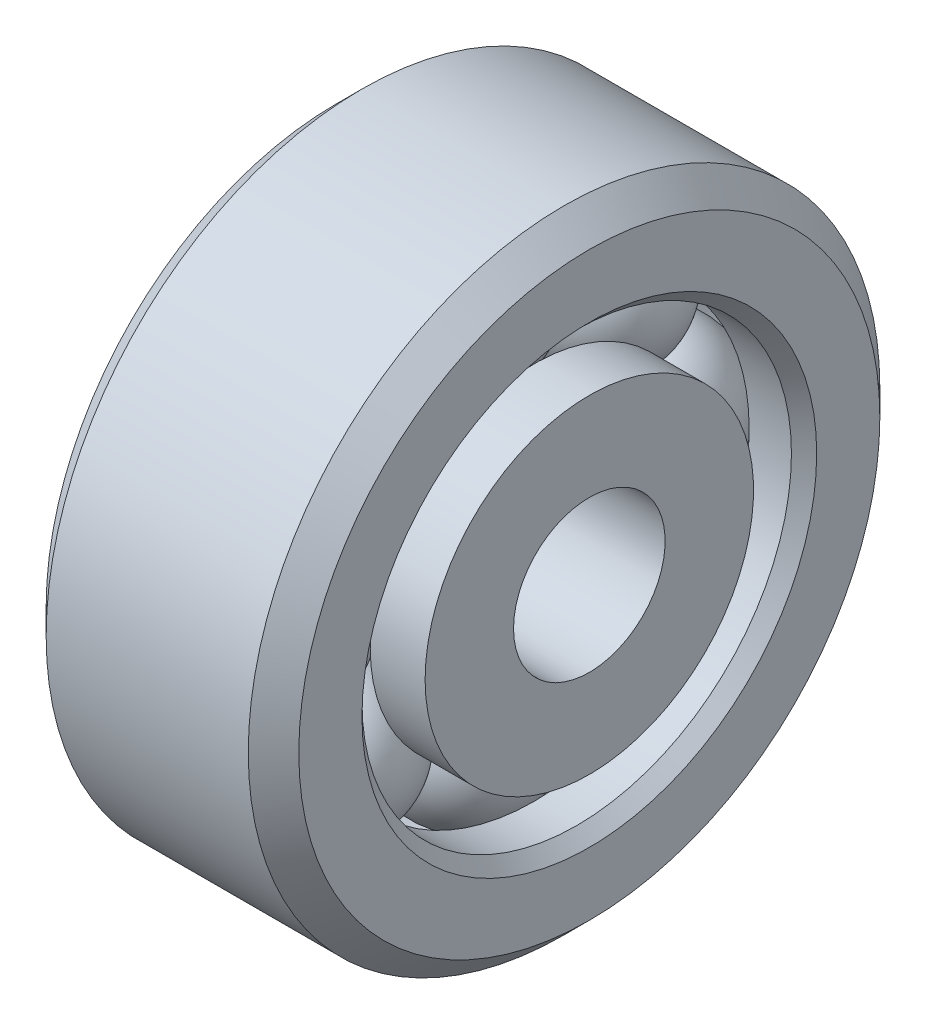
ISO-10303-21;
HEADER;
FILE_DESCRIPTION(('STEP AP214'),'2;1');
FILE_NAME('part.step','',(''),(''),'','','');
FILE_SCHEMA(('AUTOMOTIVE_DESIGN { 1 0 10303 214 1 1 1 1 }'));
ENDSEC;
DATA;
#1=APPLICATION_CONTEXT('core data for automotive mechanical design processes');
#2=APPLICATION_PROTOCOL_DEFINITION('international standard','automotive_design',2000,#1);
#3=PRODUCT_CONTEXT('',#1,'mechanical');
#4=PRODUCT('Part','Part','',(#3));
#5=PRODUCT_RELATED_PRODUCT_CATEGORY('part','',(#4));
#6=PRODUCT_DEFINITION_FORMATION('','',#4);
#7=PRODUCT_DEFINITION_CONTEXT('part definition',#1,'design');
#8=PRODUCT_DEFINITION('design','',#6,#7);
#9=PRODUCT_DEFINITION_SHAPE('','',#8);
#10=(LENGTH_UNIT() NAMED_UNIT(*) SI_UNIT(.MILLI.,.METRE.));
#11=(NAMED_UNIT(*) PLANE_ANGLE_UNIT() SI_UNIT($,.RADIAN.));
#12=(NAMED_UNIT(*) SI_UNIT($,.STERADIAN.) SOLID_ANGLE_UNIT());
#13=UNCERTAINTY_MEASURE_WITH_UNIT(LENGTH_MEASURE(1.E-05),#10,'distance_accuracy_value','');
#14=(GEOMETRIC_REPRESENTATION_CONTEXT(3) GLOBAL_UNCERTAINTY_ASSIGNED_CONTEXT((#13)) GLOBAL_UNIT_ASSIGNED_CONTEXT((#10,
#11,#12)) REPRESENTATION_CONTEXT('',''));
#15=CARTESIAN_POINT('',(0.,0.,0.));
#16=DIRECTION('',(0.,0.,1.));
#17=DIRECTION('',(1.,0.,0.));
#18=AXIS2_PLACEMENT_3D('',#15,#16,#17);
#19=CARTESIAN_POINT('',(0.,0.,0.));
#20=DIRECTION('',(-1.,0.,0.));
#21=DIRECTION('',(0.,0.,1.));
#22=AXIS2_PLACEMENT_3D('',#19,#20,#21);
#23=TOROIDAL_SURFACE('',#22,30.,12.);
#24=CARTESIAN_POINT('',(11.3137084989848,0.,0.));
#25=DIRECTION('',(-1.,0.,0.));
#26=DIRECTION('',(0.,0.,1.));
#27=AXIS2_PLACEMENT_3D('',#24,#25,#26);
#28=CIRCLE('',#27,26.);
#29=CARTESIAN_POINT('',(11.3137084989848,0.,26.));
#30=VERTEX_POINT('',#29);
#31=EDGE_CURVE('E68',#30,#30,#28,.T.);
#32=ORIENTED_EDGE('',*,*,#31,.T.);
#33=EDGE_LOOP('',(#32));
#34=FACE_BOUND('',#33,.T.);
#35=CARTESIAN_POINT('',(-11.3137084989848,0.,0.));
#36=DIRECTION('',(-1.,0.,0.));
#37=DIRECTION('',(0.,0.,1.));
#38=AXIS2_PLACEMENT_3D('',#35,#36,#37);
#39=CIRCLE('',#38,26.);
#40=CARTESIAN_POINT('',(-11.3137084989848,0.,26.));
#41=VERTEX_POINT('',#40);
#42=EDGE_CURVE('E53',#41,#41,#39,.T.);
#43=ORIENTED_EDGE('',*,*,#42,.F.);
#44=EDGE_LOOP('',(#43));
#45=FACE_BOUND('',#44,.T.);
#46=ADVANCED_FACE('F160',(#34,#45),#23,.F.);
#47=CARTESIAN_POINT('',(-240.,0.,0.));
#48=DIRECTION('',(-1.,0.,0.));
#49=DIRECTION('',(0.,0.,1.));
#50=AXIS2_PLACEMENT_3D('',#47,#48,#49);
#51=CYLINDRICAL_SURFACE('',#50,26.);
#52=CARTESIAN_POINT('',(20.,0.,0.));
#53=DIRECTION('',(-1.,0.,0.));
#54=DIRECTION('',(0.,0.,1.));
#55=AXIS2_PLACEMENT_3D('',#52,#53,#54);
#56=CIRCLE('',#55,26.);
#57=CARTESIAN_POINT('',(20.,0.,26.));
#58=VERTEX_POINT('',#57);
#59=EDGE_CURVE('E65',#58,#58,#56,.T.);
#60=ORIENTED_EDGE('',*,*,#59,.T.);
#61=EDGE_LOOP('',(#60));
#62=FACE_BOUND('',#61,.T.);
#63=ORIENTED_EDGE('',*,*,#31,.F.);
#64=EDGE_LOOP('',(#63));
#65=FACE_BOUND('',#64,.T.);
#66=ADVANCED_FACE('F219',(#62,#65),#51,.T.);
#67=CARTESIAN_POINT('',(20.,0.,26.));
#68=DIRECTION('',(1.,0.,0.));
#69=DIRECTION('',(0.,0.,-1.));
#70=AXIS2_PLACEMENT_3D('',#67,#68,#69);
#71=PLANE('',#70);
#72=CARTESIAN_POINT('',(20.,0.,0.));
#73=DIRECTION('',(-1.,0.,0.));
#74=DIRECTION('',(0.,0.,1.));
#75=AXIS2_PLACEMENT_3D('',#72,#73,#74);
#76=CIRCLE('',#75,12.);
#77=CARTESIAN_POINT('',(20.,0.,12.));
#78=VERTEX_POINT('',#77);
#79=EDGE_CURVE('E62',#78,#78,#76,.T.);
#80=ORIENTED_EDGE('',*,*,#79,.T.);
#81=EDGE_LOOP('',(#80));
#82=FACE_BOUND('',#81,.T.);
#83=ORIENTED_EDGE('',*,*,#59,.F.);
#84=EDGE_LOOP('',(#83));
#85=FACE_BOUND('',#84,.T.);
#86=ADVANCED_FACE('F224',(#82,#85),#71,.T.);
#87=CARTESIAN_POINT('',(-240.,0.,0.));
#88=DIRECTION('',(-1.,0.,0.));
#89=DIRECTION('',(0.,0.,1.));
#90=AXIS2_PLACEMENT_3D('',#87,#88,#89);
#91=CYLINDRICAL_SURFACE('',#90,12.);
#92=CARTESIAN_POINT('',(-20.,0.,0.));
#93=DIRECTION('',(-1.,0.,0.));
#94=DIRECTION('',(0.,0.,1.));
#95=AXIS2_PLACEMENT_3D('',#92,#93,#94);
#96=CIRCLE('',#95,12.);
#97=CARTESIAN_POINT('',(-20.,0.,12.));
#98=VERTEX_POINT('',#97);
#99=EDGE_CURVE('E59',#98,#98,#96,.T.);
#100=ORIENTED_EDGE('',*,*,#99,.T.);
#101=EDGE_LOOP('',(#100));
#102=FACE_BOUND('',#101,.T.);
#103=ORIENTED_EDGE('',*,*,#79,.F.);
#104=EDGE_LOOP('',(#103));
#105=FACE_BOUND('',#104,.T.);
#106=ADVANCED_FACE('F228',(#102,#105),#91,.F.);
#107=CARTESIAN_POINT('',(-20.,0.,12.));
#108=DIRECTION('',(-1.,0.,0.));
#109=DIRECTION('',(0.,0.,1.));
#110=AXIS2_PLACEMENT_3D('',#107,#108,#109);
#111=PLANE('',#110);
#112=CARTESIAN_POINT('',(-20.,0.,0.));
#113=DIRECTION('',(-1.,0.,0.));
#114=DIRECTION('',(0.,0.,1.));
#115=AXIS2_PLACEMENT_3D('',#112,#113,#114);
#116=CIRCLE('',#115,26.);
#117=CARTESIAN_POINT('',(-20.,0.,26.));
#118=VERTEX_POINT('',#117);
#119=EDGE_CURVE('E56',#118,#118,#116,.T.);
#120=ORIENTED_EDGE('',*,*,#119,.T.);
#121=EDGE_LOOP('',(#120));
#122=FACE_BOUND('',#121,.T.);
#123=ORIENTED_EDGE('',*,*,#99,.F.);
#124=EDGE_LOOP('',(#123));
#125=FACE_BOUND('',#124,.T.);
#126=ADVANCED_FACE('F232',(#122,#125),#111,.T.);
#127=CARTESIAN_POINT('',(-240.,0.,0.));
#128=DIRECTION('',(-1.,0.,0.));
#129=DIRECTION('',(0.,0.,1.));
#130=AXIS2_PLACEMENT_3D('',#127,#128,#129);
#131=CYLINDRICAL_SURFACE('',#130,26.);
#132=ORIENTED_EDGE('',*,*,#42,.T.);
#133=EDGE_LOOP('',(#132));
#134=FACE_BOUND('',#133,.T.);
#135=ORIENTED_EDGE('',*,*,#119,.F.);
#136=EDGE_LOOP('',(#135));
#137=FACE_BOUND('',#136,.T.);
#138=ADVANCED_FACE('F235',(#134,#137),#131,.T.);
#139=CLOSED_SHELL('',(#46,#66,#86,#106,#126,#138));
#140=MANIFOLD_SOLID_BREP('B2',#139);
#141=CARTESIAN_POINT('',(-20.,0.,34.));
#142=DIRECTION('',(-1.,0.,0.));
#143=DIRECTION('',(0.,0.,1.));
#144=AXIS2_PLACEMENT_3D('',#141,#142,#143);
#145=PLANE('',#144);
#146=CARTESIAN_POINT('',(-20.,0.,0.));
#147=DIRECTION('',(-1.,0.,0.));
#148=DIRECTION('',(0.,0.,1.));
#149=AXIS2_PLACEMENT_3D('',#146,#147,#148);
#150=CIRCLE('',#149,46.);
#151=CARTESIAN_POINT('',(-20.,0.,46.));
#152=VERTEX_POINT('',#151);
#153=EDGE_CURVE('E98',#152,#152,#150,.T.);
#154=ORIENTED_EDGE('',*,*,#153,.T.);
#155=EDGE_LOOP('',(#154));
#156=FACE_BOUND('',#155,.T.);
#157=CARTESIAN_POINT('',(-20.,0.,0.));
#158=DIRECTION('',(-1.,0.,0.));
#159=DIRECTION('',(0.,0.,1.));
#160=AXIS2_PLACEMENT_3D('',#157,#158,#159);
#161=CIRCLE('',#160,36.);
#162=CARTESIAN_POINT('',(-20.,0.,36.));
#163=VERTEX_POINT('',#162);
#164=EDGE_CURVE('E80',#163,#163,#161,.F.);
#165=ORIENTED_EDGE('',*,*,#164,.T.);
#166=EDGE_LOOP('',(#165));
#167=FACE_BOUND('',#166,.T.);
#168=ADVANCED_FACE('F159',(#156,#167),#145,.T.);
#169=CARTESIAN_POINT('',(-240.,0.,0.));
#170=DIRECTION('',(-1.,0.,0.));
#171=DIRECTION('',(0.,0.,1.));
#172=AXIS2_PLACEMENT_3D('',#169,#170,#171);
#173=CYLINDRICAL_SURFACE('',#172,50.);
#174=CARTESIAN_POINT('',(16.,0.,0.));
#175=DIRECTION('',(1.,0.,0.));
#176=DIRECTION('',(0.,0.,-1.));
#177=AXIS2_PLACEMENT_3D('',#174,#175,#176);
#178=CIRCLE('',#177,50.);
#179=CARTESIAN_POINT('',(16.,0.,-50.));
#180=VERTEX_POINT('',#179);
#181=EDGE_CURVE('E92',#180,#180,#178,.F.);
#182=ORIENTED_EDGE('',*,*,#181,.T.);
#183=EDGE_LOOP('',(#182));
#184=FACE_BOUND('',#183,.T.);
#185=CARTESIAN_POINT('',(-16.,0.,0.));
#186=DIRECTION('',(-1.,0.,0.));
#187=DIRECTION('',(0.,0.,1.));
#188=AXIS2_PLACEMENT_3D('',#185,#186,#187);
#189=CIRCLE('',#188,50.);
#190=CARTESIAN_POINT('',(-16.,0.,50.));
#191=VERTEX_POINT('',#190);
#192=EDGE_CURVE('E89',#191,#191,#189,.F.);
#193=ORIENTED_EDGE('',*,*,#192,.T.);
#194=EDGE_LOOP('',(#193));
#195=FACE_BOUND('',#194,.T.);
#196=ADVANCED_FACE('F162',(#184,#195),#173,.T.);
#197=CARTESIAN_POINT('',(20.,0.,50.));
#198=DIRECTION('',(1.,0.,0.));
#199=DIRECTION('',(0.,0.,-1.));
#200=AXIS2_PLACEMENT_3D('',#197,#198,#199);
#201=PLANE('',#200);
#202=CARTESIAN_POINT('',(20.,0.,0.));
#203=DIRECTION('',(1.,0.,0.));
#204=DIRECTION('',(0.,0.,-1.));
#205=AXIS2_PLACEMENT_3D('',#202,#203,#204);
#206=CIRCLE('',#205,46.);
#207=CARTESIAN_POINT('',(20.,0.,-46.));
#208=VERTEX_POINT('',#207);
#209=EDGE_CURVE('E95',#208,#208,#206,.T.);
#210=ORIENTED_EDGE('',*,*,#209,.T.);
#211=EDGE_LOOP('',(#210));
#212=FACE_BOUND('',#211,.T.);
#213=CARTESIAN_POINT('',(20.,0.,0.));
#214=DIRECTION('',(1.,0.,0.));
#215=DIRECTION('',(0.,0.,-1.));
#216=AXIS2_PLACEMENT_3D('',#213,#214,#215);
#217=CIRCLE('',#216,36.);
#218=CARTESIAN_POINT('',(20.,0.,-36.));
#219=VERTEX_POINT('',#218);
#220=EDGE_CURVE('E83',#219,#219,#217,.F.);
#221=ORIENTED_EDGE('',*,*,#220,.T.);
#222=EDGE_LOOP('',(#221));
#223=FACE_BOUND('',#222,.T.);
#224=ADVANCED_FACE('F170',(#212,#223),#201,.T.);
#225=CARTESIAN_POINT('',(-240.,0.,0.));
#226=DIRECTION('',(-1.,0.,0.));
#227=DIRECTION('',(0.,0.,1.));
#228=AXIS2_PLACEMENT_3D('',#225,#226,#227);
#229=CYLINDRICAL_SURFACE('',#228,34.);
#230=CARTESIAN_POINT('',(18.,0.,0.));
#231=DIRECTION('',(1.,0.,0.));
#232=DIRECTION('',(0.,0.,-1.));
#233=AXIS2_PLACEMENT_3D('',#230,#231,#232);
#234=CIRCLE('',#233,34.);
#235=CARTESIAN_POINT('',(18.,0.,-34.));
#236=VERTEX_POINT('',#235);
#237=EDGE_CURVE('E86',#236,#236,#234,.T.);
#238=ORIENTED_EDGE('',*,*,#237,.T.);
#239=EDGE_LOOP('',(#238));
#240=FACE_BOUND('',#239,.T.);
#241=CARTESIAN_POINT('',(11.3137084989848,0.,0.));
#242=DIRECTION('',(-1.,0.,0.));
#243=DIRECTION('',(0.,0.,1.));
#244=AXIS2_PLACEMENT_3D('',#241,#242,#243);
#245=CIRCLE('',#244,34.);
#246=CARTESIAN_POINT('',(11.3137084989848,0.,34.));
#247=VERTEX_POINT('',#246);
#248=EDGE_CURVE('E74',#247,#247,#245,.T.);
#249=ORIENTED_EDGE('',*,*,#248,.T.);
#250=EDGE_LOOP('',(#249));
#251=FACE_BOUND('',#250,.T.);
#252=ADVANCED_FACE('F201',(#240,#251),#229,.F.);
#253=CARTESIAN_POINT('',(0.,0.,0.));
#254=DIRECTION('',(-1.,0.,0.));
#255=DIRECTION('',(0.,0.,1.));
#256=AXIS2_PLACEMENT_3D('',#253,#254,#255);
#257=TOROIDAL_SURFACE('',#256,30.,12.);
#258=CARTESIAN_POINT('',(-11.3137084989847,0.,0.));
#259=DIRECTION('',(-1.,0.,0.));
#260=DIRECTION('',(0.,0.,1.));
#261=AXIS2_PLACEMENT_3D('',#258,#259,#260);
#262=CIRCLE('',#261,34.);
#263=CARTESIAN_POINT('',(-11.3137084989847,0.,34.));
#264=VERTEX_POINT('',#263);
#265=EDGE_CURVE('E71',#264,#264,#262,.T.);
#266=ORIENTED_EDGE('',*,*,#265,.T.);
#267=EDGE_LOOP('',(#266));
#268=FACE_BOUND('',#267,.T.);
#269=ORIENTED_EDGE('',*,*,#248,.F.);
#270=EDGE_LOOP('',(#269));
#271=FACE_BOUND('',#270,.T.);
#272=ADVANCED_FACE('F207',(#268,#271),#257,.F.);
#273=CARTESIAN_POINT('',(-240.,0.,0.));
#274=DIRECTION('',(-1.,0.,0.));
#275=DIRECTION('',(0.,0.,1.));
#276=AXIS2_PLACEMENT_3D('',#273,#274,#275);
#277=CYLINDRICAL_SURFACE('',#276,34.);
#278=CARTESIAN_POINT('',(-18.,0.,0.));
#279=DIRECTION('',(-1.,0.,0.));
#280=DIRECTION('',(0.,0.,1.));
#281=AXIS2_PLACEMENT_3D('',#278,#279,#280);
#282=CIRCLE('',#281,34.);
#283=CARTESIAN_POINT('',(-18.,0.,34.));
#284=VERTEX_POINT('',#283);
#285=EDGE_CURVE('E77',#284,#284,#282,.T.);
#286=ORIENTED_EDGE('',*,*,#285,.T.);
#287=EDGE_LOOP('',(#286));
#288=FACE_BOUND('',#287,.T.);
#289=ORIENTED_EDGE('',*,*,#265,.F.);
#290=EDGE_LOOP('',(#289));
#291=FACE_BOUND('',#290,.T.);
#292=ADVANCED_FACE('F181',(#288,#291),#277,.F.);
#293=CARTESIAN_POINT('',(-18.,0.,0.));
#294=DIRECTION('',(-1.,0.,0.));
#295=DIRECTION('',(0.,0.,1.));
#296=AXIS2_PLACEMENT_3D('',#293,#294,#295);
#297=CONICAL_SURFACE('',#296,34.,0.785398163397448);
#298=ORIENTED_EDGE('',*,*,#164,.F.);
#299=EDGE_LOOP('',(#298));
#300=FACE_BOUND('',#299,.T.);
#301=ORIENTED_EDGE('',*,*,#285,.F.);
#302=EDGE_LOOP('',(#301));
#303=FACE_BOUND('',#302,.T.);
#304=ADVANCED_FACE('F177',(#300,#303),#297,.F.);
#305=CARTESIAN_POINT('',(20.,0.,0.));
#306=DIRECTION('',(1.,0.,0.));
#307=DIRECTION('',(0.,0.,-1.));
#308=AXIS2_PLACEMENT_3D('',#305,#306,#307);
#309=CONICAL_SURFACE('',#308,36.,0.785398163397448);
#310=ORIENTED_EDGE('',*,*,#237,.F.);
#311=EDGE_LOOP('',(#310));
#312=FACE_BOUND('',#311,.T.);
#313=ORIENTED_EDGE('',*,*,#220,.F.);
#314=EDGE_LOOP('',(#313));
#315=FACE_BOUND('',#314,.T.);
#316=ADVANCED_FACE('F180',(#312,#315),#309,.F.);
#317=CARTESIAN_POINT('',(16.,0.,0.));
#318=DIRECTION('',(-1.,0.,0.));
#319=DIRECTION('',(0.,0.,1.));
#320=AXIS2_PLACEMENT_3D('',#317,#318,#319);
#321=CONICAL_SURFACE('',#320,50.,0.785398163397448);
#322=ORIENTED_EDGE('',*,*,#209,.F.);
#323=EDGE_LOOP('',(#322));
#324=FACE_BOUND('',#323,.T.);
#325=ORIENTED_EDGE('',*,*,#181,.F.);
#326=EDGE_LOOP('',(#325));
#327=FACE_BOUND('',#326,.T.);
#328=ADVANCED_FACE('F184',(#324,#327),#321,.T.);
#329=CARTESIAN_POINT('',(-20.,0.,0.));
#330=DIRECTION('',(1.,0.,0.));
#331=DIRECTION('',(0.,0.,-1.));
#332=AXIS2_PLACEMENT_3D('',#329,#330,#331);
#333=CONICAL_SURFACE('',#332,46.,0.785398163397448);
#334=ORIENTED_EDGE('',*,*,#192,.F.);
#335=EDGE_LOOP('',(#334));
#336=FACE_BOUND('',#335,.T.);
#337=ORIENTED_EDGE('',*,*,#153,.F.);
#338=EDGE_LOOP('',(#337));
#339=FACE_BOUND('',#338,.T.);
#340=ADVANCED_FACE('F40',(#336,#339),#333,.T.);
#341=CLOSED_SHELL('',(#168,#196,#224,#252,#272,#292,#304,#316,#328,#340));
#342=MANIFOLD_SOLID_BREP('B2',#341);
#343=CARTESIAN_POINT('',(0.,0.,30.));
#344=DIRECTION('',(-1.,0.,0.));
#345=DIRECTION('',(0.,0.,-1.));
#346=AXIS2_PLACEMENT_3D('',#343,#344,#345);
#347=SPHERICAL_SURFACE('',#346,11.6);
#348=CARTESIAN_POINT('',(0.,-10.6066017177982,25.6066017177982));
#349=DIRECTION('',(0.,-0.923879532511287,-0.38268343236509));
#350=DIRECTION('',(0.,0.38268343236509,-0.923879532511287));
#351=AXIS2_PLACEMENT_3D('',#348,#349,#350);
#352=CIRCLE('',#351,1.66073824967897);
#353=CARTESIAN_POINT('',(0.,-9.97106470415106,24.0722796400612));
#354=VERTEX_POINT('',#353);
#355=EDGE_CURVE('E10',#354,#354,#352,.T.);
#356=ORIENTED_EDGE('',*,*,#355,.F.);
#357=EDGE_LOOP('',(#356));
#358=FACE_BOUND('',#357,.T.);
#359=CARTESIAN_POINT('',(0.,10.6066017177982,25.6066017177982));
#360=DIRECTION('',(0.,0.923879532511287,-0.38268343236509));
#361=DIRECTION('',(0.,0.38268343236509,0.923879532511287));
#362=AXIS2_PLACEMENT_3D('',#359,#360,#361);
#363=CIRCLE('',#362,1.66073824967897);
#364=CARTESIAN_POINT('',(0.,11.2421387314453,27.1409237955352));
#365=VERTEX_POINT('',#364);
#366=EDGE_CURVE('E101',#365,#365,#363,.T.);
#367=ORIENTED_EDGE('',*,*,#366,.F.);
#368=EDGE_LOOP('',(#367));
#369=FACE_BOUND('',#368,.T.);
#370=ADVANCED_FACE('F38',(#358,#369),#347,.T.);
#371=CARTESIAN_POINT('',(0.,21.2132034355964,21.2132034355964));
#372=DIRECTION('',(-1.,0.,0.));
#373=DIRECTION('',(0.,-0.707106781186548,-0.707106781186547));
#374=AXIS2_PLACEMENT_3D('',#371,#372,#373);
#375=SPHERICAL_SURFACE('',#374,11.6);
#376=CARTESIAN_POINT('',(0.,25.6066017177982,10.6066017177982));
#377=DIRECTION('',(0.,0.38268343236509,-0.923879532511287));
#378=DIRECTION('',(0.,0.923879532511287,0.38268343236509));
#379=AXIS2_PLACEMENT_3D('',#376,#377,#378);
#380=CIRCLE('',#379,1.66073824967899);
#381=CARTESIAN_POINT('',(0.,27.1409237955352,11.2421387314453));
#382=VERTEX_POINT('',#381);
#383=EDGE_CURVE('E104',#382,#382,#380,.T.);
#384=ORIENTED_EDGE('',*,*,#383,.F.);
#385=EDGE_LOOP('',(#384));
#386=FACE_BOUND('',#385,.T.);
#387=ORIENTED_EDGE('',*,*,#366,.T.);
#388=EDGE_LOOP('',(#387));
#389=FACE_BOUND('',#388,.T.);
#390=ADVANCED_FACE('F141',(#386,#389),#375,.T.);
#391=CARTESIAN_POINT('',(0.,29.9999999999999,0.));
#392=DIRECTION('',(-1.,0.,0.));
#393=DIRECTION('',(0.,-1.,0.));
#394=AXIS2_PLACEMENT_3D('',#391,#392,#393);
#395=SPHERICAL_SURFACE('',#394,11.6);
#396=CARTESIAN_POINT('',(0.,25.6066017177982,-10.6066017177982));
#397=DIRECTION('',(0.,-0.38268343236509,-0.923879532511287));
#398=DIRECTION('',(0.,0.923879532511287,-0.38268343236509));
#399=AXIS2_PLACEMENT_3D('',#396,#397,#398);
#400=CIRCLE('',#399,1.66073824967899);
#401=CARTESIAN_POINT('',(0.,27.1409237955352,-11.2421387314453));
#402=VERTEX_POINT('',#401);
#403=EDGE_CURVE('E107',#402,#402,#400,.T.);
#404=ORIENTED_EDGE('',*,*,#403,.F.);
#405=EDGE_LOOP('',(#404));
#406=FACE_BOUND('',#405,.T.);
#407=ORIENTED_EDGE('',*,*,#383,.T.);
#408=EDGE_LOOP('',(#407));
#409=FACE_BOUND('',#408,.T.);
#410=ADVANCED_FACE('F135',(#406,#409),#395,.T.);
#411=CARTESIAN_POINT('',(0.,21.2132034355964,-21.2132034355964));
#412=DIRECTION('',(-1.,0.,0.));
#413=DIRECTION('',(0.,-0.707106781186547,0.707106781186548));
#414=AXIS2_PLACEMENT_3D('',#411,#412,#413);
#415=SPHERICAL_SURFACE('',#414,11.6);
#416=CARTESIAN_POINT('',(0.,10.6066017177982,-25.6066017177982));
#417=DIRECTION('',(0.,-0.923879532511287,-0.38268343236509));
#418=DIRECTION('',(0.,0.38268343236509,-0.923879532511287));
#419=AXIS2_PLACEMENT_3D('',#416,#417,#418);
#420=CIRCLE('',#419,1.66073824967898);
#421=CARTESIAN_POINT('',(0.,11.2421387314453,-27.1409237955352));
#422=VERTEX_POINT('',#421);
#423=EDGE_CURVE('E110',#422,#422,#420,.T.);
#424=ORIENTED_EDGE('',*,*,#423,.F.);
#425=EDGE_LOOP('',(#424));
#426=FACE_BOUND('',#425,.T.);
#427=ORIENTED_EDGE('',*,*,#403,.T.);
#428=EDGE_LOOP('',(#427));
#429=FACE_BOUND('',#428,.T.);
#430=ADVANCED_FACE('F129',(#426,#429),#415,.T.);
#431=CARTESIAN_POINT('',(0.,0.,-29.9999999999999));
#432=DIRECTION('',(-1.,0.,0.));
#433=DIRECTION('',(0.,0.,1.));
#434=AXIS2_PLACEMENT_3D('',#431,#432,#433);
#435=SPHERICAL_SURFACE('',#434,11.6);
#436=CARTESIAN_POINT('',(0.,-10.6066017177982,-25.6066017177982));
#437=DIRECTION('',(0.,-0.923879532511287,0.38268343236509));
#438=DIRECTION('',(0.,-0.38268343236509,-0.923879532511287));
#439=AXIS2_PLACEMENT_3D('',#436,#437,#438);
#440=CIRCLE('',#439,1.66073824967903);
#441=CARTESIAN_POINT('',(0.,-11.2421387314454,-27.1409237955352));
#442=VERTEX_POINT('',#441);
#443=EDGE_CURVE('E113',#442,#442,#440,.T.);
#444=ORIENTED_EDGE('',*,*,#443,.F.);
#445=EDGE_LOOP('',(#444));
#446=FACE_BOUND('',#445,.T.);
#447=ORIENTED_EDGE('',*,*,#423,.T.);
#448=EDGE_LOOP('',(#447));
#449=FACE_BOUND('',#448,.T.);
#450=ADVANCED_FACE('F123',(#446,#449),#435,.T.);
#451=CARTESIAN_POINT('',(0.,-21.2132034355964,-21.2132034355964));
#452=DIRECTION('',(-1.,0.,0.));
#453=DIRECTION('',(0.,0.707106781186547,0.707106781186548));
#454=AXIS2_PLACEMENT_3D('',#451,#452,#453);
#455=SPHERICAL_SURFACE('',#454,11.6);
#456=CARTESIAN_POINT('',(0.,-25.6066017177982,-10.6066017177982));
#457=DIRECTION('',(0.,-0.38268343236509,0.923879532511287));
#458=DIRECTION('',(0.,-0.923879532511287,-0.38268343236509));
#459=AXIS2_PLACEMENT_3D('',#456,#457,#458);
#460=CIRCLE('',#459,1.66073824967897);
#461=CARTESIAN_POINT('',(0.,-27.1409237955352,-11.2421387314453));
#462=VERTEX_POINT('',#461);
#463=EDGE_CURVE('E51',#462,#462,#460,.T.);
#464=ORIENTED_EDGE('',*,*,#463,.F.);
#465=EDGE_LOOP('',(#464));
#466=FACE_BOUND('',#465,.T.);
#467=ORIENTED_EDGE('',*,*,#443,.T.);
#468=EDGE_LOOP('',(#467));
#469=FACE_BOUND('',#468,.T.);
#470=ADVANCED_FACE('F120',(#466,#469),#455,.T.);
#471=CARTESIAN_POINT('',(0.,-29.9999999999999,0.));
#472=DIRECTION('',(-1.,0.,0.));
#473=DIRECTION('',(0.,1.,0.));
#474=AXIS2_PLACEMENT_3D('',#471,#472,#473);
#475=SPHERICAL_SURFACE('',#474,11.6);
#476=CARTESIAN_POINT('',(0.,-25.6066017177982,10.6066017177982));
#477=DIRECTION('',(0.,0.38268343236509,0.923879532511287));
#478=DIRECTION('',(0.,-0.923879532511287,0.38268343236509));
#479=AXIS2_PLACEMENT_3D('',#476,#477,#478);
#480=CIRCLE('',#479,1.66073824967899);
#481=CARTESIAN_POINT('',(0.,-27.1409237955352,11.2421387314454));
#482=VERTEX_POINT('',#481);
#483=EDGE_CURVE('E42',#482,#482,#480,.T.);
#484=ORIENTED_EDGE('',*,*,#483,.F.);
#485=EDGE_LOOP('',(#484));
#486=FACE_BOUND('',#485,.T.);
#487=ORIENTED_EDGE('',*,*,#463,.T.);
#488=EDGE_LOOP('',(#487));
#489=FACE_BOUND('',#488,.T.);
#490=ADVANCED_FACE('F118',(#486,#489),#475,.T.);
#491=CARTESIAN_POINT('',(0.,-21.2132034355964,21.2132034355964));
#492=DIRECTION('',(-1.,0.,0.));
#493=DIRECTION('',(0.,0.707106781186548,-0.707106781186547));
#494=AXIS2_PLACEMENT_3D('',#491,#492,#493);
#495=SPHERICAL_SURFACE('',#494,11.6);
#496=ORIENTED_EDGE('',*,*,#355,.T.);
#497=EDGE_LOOP('',(#496));
#498=FACE_BOUND('',#497,.T.);
#499=ORIENTED_EDGE('',*,*,#483,.T.);
#500=EDGE_LOOP('',(#499));
#501=FACE_BOUND('',#500,.T.);
#502=ADVANCED_FACE('F391',(#498,#501),#495,.T.);
#503=CLOSED_SHELL('',(#370,#390,#410,#430,#450,#470,#490,#502));
#504=MANIFOLD_SOLID_BREP('B2',#503);
#505=ADVANCED_BREP_SHAPE_REPRESENTATION('',(#18,#140,#342,#504),#14);
#506=SHAPE_DEFINITION_REPRESENTATION(#9,#505);
ENDSEC;
END-ISO-10303-21;
